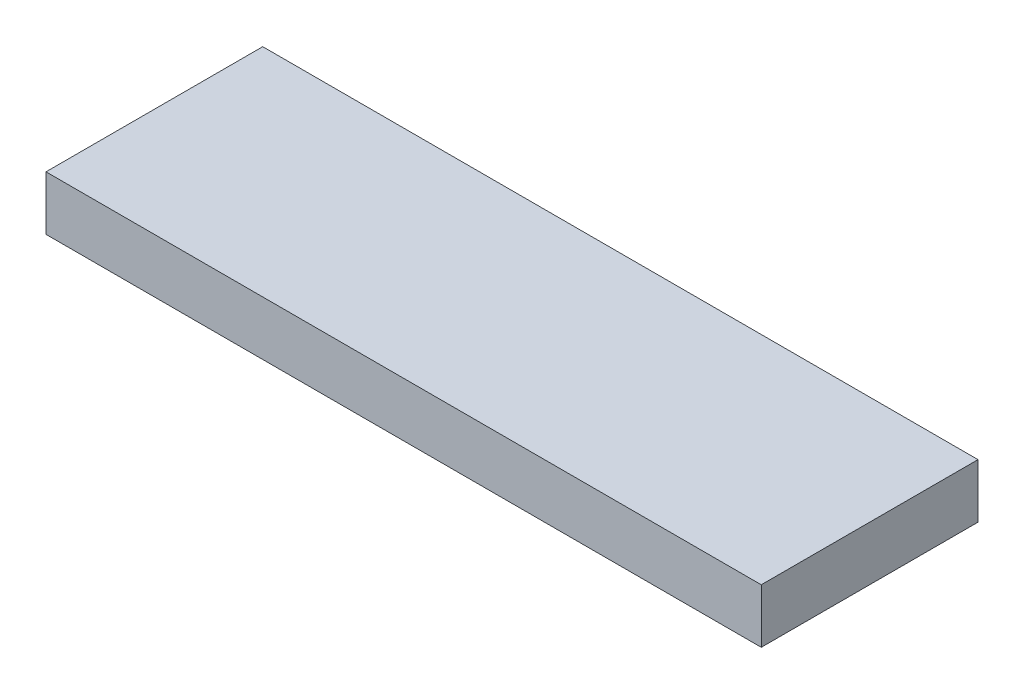
ISO-10303-21;
HEADER;
FILE_DESCRIPTION(('STEP AP214'),'2;1');
FILE_NAME('part.step','',(''),(''),'','','');
FILE_SCHEMA(('AUTOMOTIVE_DESIGN { 1 0 10303 214 1 1 1 1 }'));
ENDSEC;
DATA;
#1=APPLICATION_CONTEXT('core data for automotive mechanical design processes');
#2=APPLICATION_PROTOCOL_DEFINITION('international standard','automotive_design',2000,#1);
#3=PRODUCT_CONTEXT('',#1,'mechanical');
#4=PRODUCT('Part','Part','',(#3));
#5=PRODUCT_RELATED_PRODUCT_CATEGORY('part','',(#4));
#6=PRODUCT_DEFINITION_FORMATION('','',#4);
#7=PRODUCT_DEFINITION_CONTEXT('part definition',#1,'design');
#8=PRODUCT_DEFINITION('design','',#6,#7);
#9=PRODUCT_DEFINITION_SHAPE('','',#8);
#10=(LENGTH_UNIT() NAMED_UNIT(*) SI_UNIT(.MILLI.,.METRE.));
#11=(NAMED_UNIT(*) PLANE_ANGLE_UNIT() SI_UNIT($,.RADIAN.));
#12=(NAMED_UNIT(*) SI_UNIT($,.STERADIAN.) SOLID_ANGLE_UNIT());
#13=UNCERTAINTY_MEASURE_WITH_UNIT(LENGTH_MEASURE(1.E-05),#10,'distance_accuracy_value','');
#14=(GEOMETRIC_REPRESENTATION_CONTEXT(3) GLOBAL_UNCERTAINTY_ASSIGNED_CONTEXT((#13)) GLOBAL_UNIT_ASSIGNED_CONTEXT((#10,
#11,#12)) REPRESENTATION_CONTEXT('',''));
#15=CARTESIAN_POINT('',(0.,0.,0.));
#16=DIRECTION('',(0.,0.,1.));
#17=DIRECTION('',(1.,0.,0.));
#18=AXIS2_PLACEMENT_3D('',#15,#16,#17);
#19=CARTESIAN_POINT('',(-20.955,3.175,-6.35));
#20=DIRECTION('',(1.,0.,0.));
#21=DIRECTION('',(0.,0.,-1.));
#22=AXIS2_PLACEMENT_3D('',#19,#20,#21);
#23=PLANE('',#22);
#24=DIRECTION('',(0.,0.,1.));
#25=VECTOR('',#24,1.);
#26=CARTESIAN_POINT('',(-20.955,0.,-6.35));
#27=LINE('',#26,#25);
#28=CARTESIAN_POINT('',(-20.955,0.,-6.35));
#29=VERTEX_POINT('',#28);
#30=CARTESIAN_POINT('',(-20.955,0.,6.35));
#31=VERTEX_POINT('',#30);
#32=EDGE_CURVE('E96',#29,#31,#27,.T.);
#33=ORIENTED_EDGE('',*,*,#32,.T.);
#34=DIRECTION('',(0.,-1.,0.));
#35=VECTOR('',#34,1.);
#36=CARTESIAN_POINT('',(-20.955,3.175,6.35));
#37=LINE('',#36,#35);
#38=CARTESIAN_POINT('',(-20.955,3.175,6.35));
#39=VERTEX_POINT('',#38);
#40=EDGE_CURVE('E11',#39,#31,#37,.T.);
#41=ORIENTED_EDGE('',*,*,#40,.F.);
#42=DIRECTION('',(0.,0.,1.));
#43=VECTOR('',#42,1.);
#44=CARTESIAN_POINT('',(-20.955,3.175,-6.35));
#45=LINE('',#44,#43);
#46=CARTESIAN_POINT('',(-20.955,3.175,-6.35));
#47=VERTEX_POINT('',#46);
#48=EDGE_CURVE('E84',#47,#39,#45,.T.);
#49=ORIENTED_EDGE('',*,*,#48,.F.);
#50=DIRECTION('',(0.,-1.,0.));
#51=VECTOR('',#50,1.);
#52=CARTESIAN_POINT('',(-20.955,3.175,-6.35));
#53=LINE('',#52,#51);
#54=EDGE_CURVE('E92',#47,#29,#53,.T.);
#55=ORIENTED_EDGE('',*,*,#54,.T.);
#56=EDGE_LOOP('',(#33,#41,#49,#55));
#57=FACE_BOUND('',#56,.T.);
#58=ADVANCED_FACE('F33',(#57),#23,.F.);
#59=CARTESIAN_POINT('',(-20.955,3.175,6.35));
#60=DIRECTION('',(0.,0.,-1.));
#61=DIRECTION('',(-1.,0.,0.));
#62=AXIS2_PLACEMENT_3D('',#59,#60,#61);
#63=PLANE('',#62);
#64=DIRECTION('',(1.,0.,0.));
#65=VECTOR('',#64,1.);
#66=CARTESIAN_POINT('',(-20.955,0.,6.35));
#67=LINE('',#66,#65);
#68=CARTESIAN_POINT('',(20.955,0.,6.35));
#69=VERTEX_POINT('',#68);
#70=EDGE_CURVE('E88',#31,#69,#67,.T.);
#71=ORIENTED_EDGE('',*,*,#70,.T.);
#72=DIRECTION('',(0.,-1.,0.));
#73=VECTOR('',#72,1.);
#74=CARTESIAN_POINT('',(20.955,3.175,6.35));
#75=LINE('',#74,#73);
#76=CARTESIAN_POINT('',(20.955,3.175,6.35));
#77=VERTEX_POINT('',#76);
#78=EDGE_CURVE('E41',#77,#69,#75,.T.);
#79=ORIENTED_EDGE('',*,*,#78,.F.);
#80=DIRECTION('',(1.,0.,0.));
#81=VECTOR('',#80,1.);
#82=CARTESIAN_POINT('',(-20.955,3.175,6.35));
#83=LINE('',#82,#81);
#84=EDGE_CURVE('E79',#39,#77,#83,.T.);
#85=ORIENTED_EDGE('',*,*,#84,.F.);
#86=ORIENTED_EDGE('',*,*,#40,.T.);
#87=EDGE_LOOP('',(#71,#79,#85,#86));
#88=FACE_BOUND('',#87,.T.);
#89=ADVANCED_FACE('F87',(#88),#63,.F.);
#90=CARTESIAN_POINT('',(20.955,3.175,-6.35));
#91=DIRECTION('',(-1.,0.,0.));
#92=DIRECTION('',(0.,0.,1.));
#93=AXIS2_PLACEMENT_3D('',#90,#91,#92);
#94=PLANE('',#93);
#95=DIRECTION('',(0.,0.,-1.));
#96=VECTOR('',#95,1.);
#97=CARTESIAN_POINT('',(20.955,0.,-6.35));
#98=LINE('',#97,#96);
#99=CARTESIAN_POINT('',(20.955,0.,-6.35));
#100=VERTEX_POINT('',#99);
#101=EDGE_CURVE('E66',#69,#100,#98,.T.);
#102=ORIENTED_EDGE('',*,*,#101,.T.);
#103=DIRECTION('',(0.,-1.,0.));
#104=VECTOR('',#103,1.);
#105=CARTESIAN_POINT('',(20.955,3.175,-6.35));
#106=LINE('',#105,#104);
#107=CARTESIAN_POINT('',(20.955,3.175,-6.35));
#108=VERTEX_POINT('',#107);
#109=EDGE_CURVE('E89',#108,#100,#106,.T.);
#110=ORIENTED_EDGE('',*,*,#109,.F.);
#111=DIRECTION('',(0.,0.,-1.));
#112=VECTOR('',#111,1.);
#113=CARTESIAN_POINT('',(20.955,3.175,-6.35));
#114=LINE('',#113,#112);
#115=EDGE_CURVE('E82',#77,#108,#114,.T.);
#116=ORIENTED_EDGE('',*,*,#115,.F.);
#117=ORIENTED_EDGE('',*,*,#78,.T.);
#118=EDGE_LOOP('',(#102,#110,#116,#117));
#119=FACE_BOUND('',#118,.T.);
#120=ADVANCED_FACE('F90',(#119),#94,.F.);
#121=CARTESIAN_POINT('',(-20.955,3.175,-6.35));
#122=DIRECTION('',(0.,0.,1.));
#123=DIRECTION('',(1.,0.,0.));
#124=AXIS2_PLACEMENT_3D('',#121,#122,#123);
#125=PLANE('',#124);
#126=DIRECTION('',(-1.,0.,0.));
#127=VECTOR('',#126,1.);
#128=CARTESIAN_POINT('',(-20.955,0.,-6.35));
#129=LINE('',#128,#127);
#130=EDGE_CURVE('E72',#100,#29,#129,.T.);
#131=ORIENTED_EDGE('',*,*,#130,.T.);
#132=ORIENTED_EDGE('',*,*,#54,.F.);
#133=DIRECTION('',(-1.,0.,0.));
#134=VECTOR('',#133,1.);
#135=CARTESIAN_POINT('',(-20.955,3.175,-6.35));
#136=LINE('',#135,#134);
#137=EDGE_CURVE('E49',#108,#47,#136,.T.);
#138=ORIENTED_EDGE('',*,*,#137,.F.);
#139=ORIENTED_EDGE('',*,*,#109,.T.);
#140=EDGE_LOOP('',(#131,#132,#138,#139));
#141=FACE_BOUND('',#140,.T.);
#142=ADVANCED_FACE('F103',(#141),#125,.F.);
#143=CARTESIAN_POINT('',(0.,3.175,0.));
#144=DIRECTION('',(0.,1.,0.));
#145=DIRECTION('',(0.,0.,1.));
#146=AXIS2_PLACEMENT_3D('',#143,#144,#145);
#147=PLANE('',#146);
#148=ORIENTED_EDGE('',*,*,#48,.T.);
#149=ORIENTED_EDGE('',*,*,#84,.T.);
#150=ORIENTED_EDGE('',*,*,#115,.T.);
#151=ORIENTED_EDGE('',*,*,#137,.T.);
#152=EDGE_LOOP('',(#148,#149,#150,#151));
#153=FACE_BOUND('',#152,.T.);
#154=ADVANCED_FACE('F80',(#153),#147,.T.);
#155=CARTESIAN_POINT('',(0.,0.,0.));
#156=DIRECTION('',(0.,1.,0.));
#157=DIRECTION('',(0.,0.,1.));
#158=AXIS2_PLACEMENT_3D('',#155,#156,#157);
#159=PLANE('',#158);
#160=ORIENTED_EDGE('',*,*,#32,.F.);
#161=ORIENTED_EDGE('',*,*,#130,.F.);
#162=ORIENTED_EDGE('',*,*,#101,.F.);
#163=ORIENTED_EDGE('',*,*,#70,.F.);
#164=EDGE_LOOP('',(#160,#161,#162,#163));
#165=FACE_BOUND('',#164,.T.);
#166=ADVANCED_FACE('F106',(#165),#159,.F.);
#167=CLOSED_SHELL('',(#58,#89,#120,#142,#154,#166));
#168=MANIFOLD_SOLID_BREP('B2',#167);
#169=ADVANCED_BREP_SHAPE_REPRESENTATION('',(#18,#168),#14);
#170=SHAPE_DEFINITION_REPRESENTATION(#9,#169);
ENDSEC;
END-ISO-10303-21;
